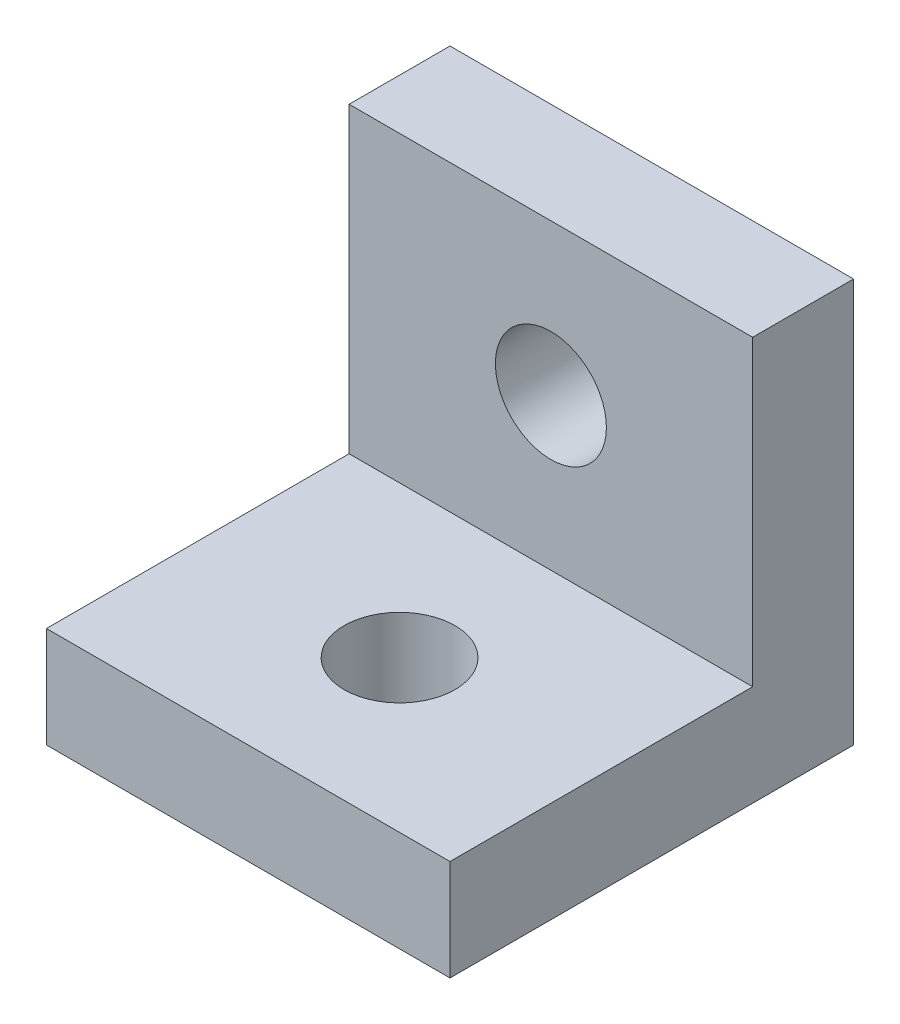
ISO-10303-21;
HEADER;
FILE_DESCRIPTION(('STEP AP214'),'2;1');
FILE_NAME('part.step','',(''),(''),'','','');
FILE_SCHEMA(('AUTOMOTIVE_DESIGN { 1 0 10303 214 1 1 1 1 }'));
ENDSEC;
DATA;
#1=APPLICATION_CONTEXT('core data for automotive mechanical design processes');
#2=APPLICATION_PROTOCOL_DEFINITION('international standard','automotive_design',2000,#1);
#3=PRODUCT_CONTEXT('',#1,'mechanical');
#4=PRODUCT('Part','Part','',(#3));
#5=PRODUCT_RELATED_PRODUCT_CATEGORY('part','',(#4));
#6=PRODUCT_DEFINITION_FORMATION('','',#4);
#7=PRODUCT_DEFINITION_CONTEXT('part definition',#1,'design');
#8=PRODUCT_DEFINITION('design','',#6,#7);
#9=PRODUCT_DEFINITION_SHAPE('','',#8);
#10=(LENGTH_UNIT() NAMED_UNIT(*) SI_UNIT(.MILLI.,.METRE.));
#11=(NAMED_UNIT(*) PLANE_ANGLE_UNIT() SI_UNIT($,.RADIAN.));
#12=(NAMED_UNIT(*) SI_UNIT($,.STERADIAN.) SOLID_ANGLE_UNIT());
#13=UNCERTAINTY_MEASURE_WITH_UNIT(LENGTH_MEASURE(1.E-05),#10,'distance_accuracy_value','');
#14=(GEOMETRIC_REPRESENTATION_CONTEXT(3) GLOBAL_UNCERTAINTY_ASSIGNED_CONTEXT((#13)) GLOBAL_UNIT_ASSIGNED_CONTEXT((#10,
#11,#12)) REPRESENTATION_CONTEXT('',''));
#15=CARTESIAN_POINT('',(0.,0.,0.));
#16=DIRECTION('',(0.,0.,1.));
#17=DIRECTION('',(1.,0.,0.));
#18=AXIS2_PLACEMENT_3D('',#15,#16,#17);
#19=CARTESIAN_POINT('',(0.,0.,2.54));
#20=DIRECTION('',(0.,0.,-1.));
#21=DIRECTION('',(-1.,0.,0.));
#22=AXIS2_PLACEMENT_3D('',#19,#20,#21);
#23=PLANE('',#22);
#24=CARTESIAN_POINT('',(5.08,6.35,2.54));
#25=DIRECTION('',(0.,0.,1.));
#26=DIRECTION('',(1.,0.,0.));
#27=AXIS2_PLACEMENT_3D('',#24,#25,#26);
#28=CIRCLE('',#27,1.397);
#29=CARTESIAN_POINT('',(6.477,6.35,2.54));
#30=VERTEX_POINT('',#29);
#31=EDGE_CURVE('E203',#30,#30,#28,.T.);
#32=ORIENTED_EDGE('',*,*,#31,.F.);
#33=EDGE_LOOP('',(#32));
#34=FACE_BOUND('',#33,.T.);
#35=DIRECTION('',(-1.,0.,0.));
#36=VECTOR('',#35,1.);
#37=CARTESIAN_POINT('',(0.,2.54,2.54));
#38=LINE('',#37,#36);
#39=CARTESIAN_POINT('',(10.16,2.54,2.54));
#40=VERTEX_POINT('',#39);
#41=CARTESIAN_POINT('',(0.,2.54,2.54));
#42=VERTEX_POINT('',#41);
#43=EDGE_CURVE('E56',#40,#42,#38,.T.);
#44=ORIENTED_EDGE('',*,*,#43,.F.);
#45=DIRECTION('',(0.,1.,0.));
#46=VECTOR('',#45,1.);
#47=CARTESIAN_POINT('',(10.16,0.,2.54));
#48=LINE('',#47,#46);
#49=CARTESIAN_POINT('',(10.16,10.16,2.54));
#50=VERTEX_POINT('',#49);
#51=EDGE_CURVE('E160',#40,#50,#48,.T.);
#52=ORIENTED_EDGE('',*,*,#51,.T.);
#53=DIRECTION('',(-1.,0.,0.));
#54=VECTOR('',#53,1.);
#55=CARTESIAN_POINT('',(0.,10.16,2.54));
#56=LINE('',#55,#54);
#57=CARTESIAN_POINT('',(0.,10.16,2.54));
#58=VERTEX_POINT('',#57);
#59=EDGE_CURVE('E62',#50,#58,#56,.T.);
#60=ORIENTED_EDGE('',*,*,#59,.T.);
#61=DIRECTION('',(0.,-1.,0.));
#62=VECTOR('',#61,1.);
#63=CARTESIAN_POINT('',(0.,0.,2.54));
#64=LINE('',#63,#62);
#65=EDGE_CURVE('E92',#58,#42,#64,.T.);
#66=ORIENTED_EDGE('',*,*,#65,.T.);
#67=EDGE_LOOP('',(#44,#52,#60,#66));
#68=FACE_BOUND('',#67,.T.);
#69=ADVANCED_FACE('F39',(#34,#68),#23,.F.);
#70=CARTESIAN_POINT('',(0.,0.,2.54));
#71=DIRECTION('',(1.,0.,0.));
#72=DIRECTION('',(0.,0.,-1.));
#73=AXIS2_PLACEMENT_3D('',#70,#71,#72);
#74=PLANE('',#73);
#75=DIRECTION('',(0.,-1.,0.));
#76=VECTOR('',#75,1.);
#77=CARTESIAN_POINT('',(0.,0.,0.));
#78=LINE('',#77,#76);
#79=CARTESIAN_POINT('',(0.,10.16,0.));
#80=VERTEX_POINT('',#79);
#81=CARTESIAN_POINT('',(0.,0.,0.));
#82=VERTEX_POINT('',#81);
#83=EDGE_CURVE('E98',#80,#82,#78,.T.);
#84=ORIENTED_EDGE('',*,*,#83,.T.);
#85=DIRECTION('',(0.,0.,-1.));
#86=VECTOR('',#85,1.);
#87=CARTESIAN_POINT('',(0.,0.,2.54));
#88=LINE('',#87,#86);
#89=CARTESIAN_POINT('',(0.,0.,10.16));
#90=VERTEX_POINT('',#89);
#91=EDGE_CURVE('E11',#90,#82,#88,.T.);
#92=ORIENTED_EDGE('',*,*,#91,.F.);
#93=DIRECTION('',(0.,-1.,0.));
#94=VECTOR('',#93,1.);
#95=CARTESIAN_POINT('',(0.,0.,10.16));
#96=LINE('',#95,#94);
#97=CARTESIAN_POINT('',(0.,2.54,10.16));
#98=VERTEX_POINT('',#97);
#99=EDGE_CURVE('E143',#98,#90,#96,.T.);
#100=ORIENTED_EDGE('',*,*,#99,.F.);
#101=DIRECTION('',(0.,0.,-1.));
#102=VECTOR('',#101,1.);
#103=CARTESIAN_POINT('',(0.,2.54,10.16));
#104=LINE('',#103,#102);
#105=EDGE_CURVE('E111',#98,#42,#104,.T.);
#106=ORIENTED_EDGE('',*,*,#105,.T.);
#107=ORIENTED_EDGE('',*,*,#65,.F.);
#108=DIRECTION('',(0.,0.,-1.));
#109=VECTOR('',#108,1.);
#110=CARTESIAN_POINT('',(0.,10.16,2.54));
#111=LINE('',#110,#109);
#112=EDGE_CURVE('E84',#58,#80,#111,.T.);
#113=ORIENTED_EDGE('',*,*,#112,.T.);
#114=EDGE_LOOP('',(#84,#92,#100,#106,#107,#113));
#115=FACE_BOUND('',#114,.T.);
#116=ADVANCED_FACE('F41',(#115),#74,.F.);
#117=CARTESIAN_POINT('',(0.,0.,2.54));
#118=DIRECTION('',(0.,1.,0.));
#119=DIRECTION('',(0.,0.,1.));
#120=AXIS2_PLACEMENT_3D('',#117,#118,#119);
#121=PLANE('',#120);
#122=CARTESIAN_POINT('',(5.08,0.,6.35));
#123=DIRECTION('',(0.,1.,0.));
#124=DIRECTION('',(0.,0.,1.));
#125=AXIS2_PLACEMENT_3D('',#122,#123,#124);
#126=CIRCLE('',#125,1.397);
#127=CARTESIAN_POINT('',(5.08,0.,7.747));
#128=VERTEX_POINT('',#127);
#129=EDGE_CURVE('E200',#128,#128,#126,.T.);
#130=ORIENTED_EDGE('',*,*,#129,.T.);
#131=EDGE_LOOP('',(#130));
#132=FACE_BOUND('',#131,.T.);
#133=DIRECTION('',(1.,0.,0.));
#134=VECTOR('',#133,1.);
#135=CARTESIAN_POINT('',(0.,0.,0.));
#136=LINE('',#135,#134);
#137=CARTESIAN_POINT('',(10.16,0.,0.));
#138=VERTEX_POINT('',#137);
#139=EDGE_CURVE('E103',#82,#138,#136,.T.);
#140=ORIENTED_EDGE('',*,*,#139,.T.);
#141=DIRECTION('',(0.,0.,-1.));
#142=VECTOR('',#141,1.);
#143=CARTESIAN_POINT('',(10.16,0.,2.54));
#144=LINE('',#143,#142);
#145=CARTESIAN_POINT('',(10.16,0.,10.16));
#146=VERTEX_POINT('',#145);
#147=EDGE_CURVE('E49',#146,#138,#144,.T.);
#148=ORIENTED_EDGE('',*,*,#147,.F.);
#149=DIRECTION('',(1.,0.,0.));
#150=VECTOR('',#149,1.);
#151=CARTESIAN_POINT('',(0.,0.,10.16));
#152=LINE('',#151,#150);
#153=EDGE_CURVE('E135',#90,#146,#152,.T.);
#154=ORIENTED_EDGE('',*,*,#153,.F.);
#155=ORIENTED_EDGE('',*,*,#91,.T.);
#156=EDGE_LOOP('',(#140,#148,#154,#155));
#157=FACE_BOUND('',#156,.T.);
#158=ADVANCED_FACE('F133',(#132,#157),#121,.F.);
#159=CARTESIAN_POINT('',(10.16,0.,2.54));
#160=DIRECTION('',(-1.,0.,0.));
#161=DIRECTION('',(0.,0.,1.));
#162=AXIS2_PLACEMENT_3D('',#159,#160,#161);
#163=PLANE('',#162);
#164=DIRECTION('',(0.,1.,0.));
#165=VECTOR('',#164,1.);
#166=CARTESIAN_POINT('',(10.16,0.,0.));
#167=LINE('',#166,#165);
#168=CARTESIAN_POINT('',(10.16,10.16,0.));
#169=VERTEX_POINT('',#168);
#170=EDGE_CURVE('E93',#138,#169,#167,.T.);
#171=ORIENTED_EDGE('',*,*,#170,.T.);
#172=DIRECTION('',(0.,0.,-1.));
#173=VECTOR('',#172,1.);
#174=CARTESIAN_POINT('',(10.16,10.16,2.54));
#175=LINE('',#174,#173);
#176=EDGE_CURVE('E87',#50,#169,#175,.T.);
#177=ORIENTED_EDGE('',*,*,#176,.F.);
#178=ORIENTED_EDGE('',*,*,#51,.F.);
#179=DIRECTION('',(0.,0.,-1.));
#180=VECTOR('',#179,1.);
#181=CARTESIAN_POINT('',(10.16,2.54,10.16));
#182=LINE('',#181,#180);
#183=CARTESIAN_POINT('',(10.16,2.54,10.16));
#184=VERTEX_POINT('',#183);
#185=EDGE_CURVE('E105',#184,#40,#182,.T.);
#186=ORIENTED_EDGE('',*,*,#185,.F.);
#187=DIRECTION('',(0.,1.,0.));
#188=VECTOR('',#187,1.);
#189=CARTESIAN_POINT('',(10.16,0.,10.16));
#190=LINE('',#189,#188);
#191=EDGE_CURVE('E129',#146,#184,#190,.T.);
#192=ORIENTED_EDGE('',*,*,#191,.F.);
#193=ORIENTED_EDGE('',*,*,#147,.T.);
#194=EDGE_LOOP('',(#171,#177,#178,#186,#192,#193));
#195=FACE_BOUND('',#194,.T.);
#196=ADVANCED_FACE('F125',(#195),#163,.F.);
#197=CARTESIAN_POINT('',(0.,10.16,2.54));
#198=DIRECTION('',(0.,-1.,0.));
#199=DIRECTION('',(0.,0.,-1.));
#200=AXIS2_PLACEMENT_3D('',#197,#198,#199);
#201=PLANE('',#200);
#202=DIRECTION('',(-1.,0.,0.));
#203=VECTOR('',#202,1.);
#204=CARTESIAN_POINT('',(0.,10.16,0.));
#205=LINE('',#204,#203);
#206=EDGE_CURVE('E81',#169,#80,#205,.T.);
#207=ORIENTED_EDGE('',*,*,#206,.T.);
#208=ORIENTED_EDGE('',*,*,#112,.F.);
#209=ORIENTED_EDGE('',*,*,#59,.F.);
#210=ORIENTED_EDGE('',*,*,#176,.T.);
#211=EDGE_LOOP('',(#207,#208,#209,#210));
#212=FACE_BOUND('',#211,.T.);
#213=ADVANCED_FACE('F83',(#212),#201,.F.);
#214=CARTESIAN_POINT('',(0.,0.,0.));
#215=DIRECTION('',(0.,0.,-1.));
#216=DIRECTION('',(-1.,0.,0.));
#217=AXIS2_PLACEMENT_3D('',#214,#215,#216);
#218=PLANE('',#217);
#219=CARTESIAN_POINT('',(5.08,6.35,0.));
#220=DIRECTION('',(0.,0.,-1.));
#221=DIRECTION('',(-1.,0.,0.));
#222=AXIS2_PLACEMENT_3D('',#219,#220,#221);
#223=CIRCLE('',#222,1.397);
#224=CARTESIAN_POINT('',(3.683,6.35,0.));
#225=VERTEX_POINT('',#224);
#226=EDGE_CURVE('E43',#225,#225,#223,.T.);
#227=ORIENTED_EDGE('',*,*,#226,.F.);
#228=EDGE_LOOP('',(#227));
#229=FACE_BOUND('',#228,.T.);
#230=ORIENTED_EDGE('',*,*,#83,.F.);
#231=ORIENTED_EDGE('',*,*,#206,.F.);
#232=ORIENTED_EDGE('',*,*,#170,.F.);
#233=ORIENTED_EDGE('',*,*,#139,.F.);
#234=EDGE_LOOP('',(#230,#231,#232,#233));
#235=FACE_BOUND('',#234,.T.);
#236=ADVANCED_FACE('F102',(#229,#235),#218,.T.);
#237=CARTESIAN_POINT('',(0.,2.54,10.16));
#238=DIRECTION('',(0.,-1.,0.));
#239=DIRECTION('',(0.,0.,-1.));
#240=AXIS2_PLACEMENT_3D('',#237,#238,#239);
#241=PLANE('',#240);
#242=CARTESIAN_POINT('',(5.08,2.54,6.35));
#243=DIRECTION('',(0.,1.,0.));
#244=DIRECTION('',(0.,0.,1.));
#245=AXIS2_PLACEMENT_3D('',#242,#243,#244);
#246=CIRCLE('',#245,1.397);
#247=CARTESIAN_POINT('',(5.08,2.54,7.747));
#248=VERTEX_POINT('',#247);
#249=EDGE_CURVE('E204',#248,#248,#246,.T.);
#250=ORIENTED_EDGE('',*,*,#249,.F.);
#251=EDGE_LOOP('',(#250));
#252=FACE_BOUND('',#251,.T.);
#253=ORIENTED_EDGE('',*,*,#43,.T.);
#254=ORIENTED_EDGE('',*,*,#105,.F.);
#255=DIRECTION('',(-1.,0.,0.));
#256=VECTOR('',#255,1.);
#257=CARTESIAN_POINT('',(0.,2.54,10.16));
#258=LINE('',#257,#256);
#259=EDGE_CURVE('E148',#184,#98,#258,.T.);
#260=ORIENTED_EDGE('',*,*,#259,.F.);
#261=ORIENTED_EDGE('',*,*,#185,.T.);
#262=EDGE_LOOP('',(#253,#254,#260,#261));
#263=FACE_BOUND('',#262,.T.);
#264=ADVANCED_FACE('F165',(#252,#263),#241,.F.);
#265=CARTESIAN_POINT('',(0.,0.,10.16));
#266=DIRECTION('',(0.,0.,-1.));
#267=DIRECTION('',(-1.,0.,0.));
#268=AXIS2_PLACEMENT_3D('',#265,#266,#267);
#269=PLANE('',#268);
#270=ORIENTED_EDGE('',*,*,#99,.T.);
#271=ORIENTED_EDGE('',*,*,#153,.T.);
#272=ORIENTED_EDGE('',*,*,#191,.T.);
#273=ORIENTED_EDGE('',*,*,#259,.T.);
#274=EDGE_LOOP('',(#270,#271,#272,#273));
#275=FACE_BOUND('',#274,.T.);
#276=ADVANCED_FACE('F140',(#275),#269,.F.);
#277=CARTESIAN_POINT('',(5.08,6.35,-7.62));
#278=DIRECTION('',(0.,0.,1.));
#279=DIRECTION('',(1.,0.,0.));
#280=AXIS2_PLACEMENT_3D('',#277,#278,#279);
#281=CYLINDRICAL_SURFACE('',#280,1.397);
#282=ORIENTED_EDGE('',*,*,#226,.T.);
#283=EDGE_LOOP('',(#282));
#284=FACE_BOUND('',#283,.T.);
#285=ORIENTED_EDGE('',*,*,#31,.T.);
#286=EDGE_LOOP('',(#285));
#287=FACE_BOUND('',#286,.T.);
#288=ADVANCED_FACE('F178',(#284,#287),#281,.F.);
#289=CARTESIAN_POINT('',(5.08,-7.62,6.35));
#290=DIRECTION('',(0.,1.,0.));
#291=DIRECTION('',(0.,0.,1.));
#292=AXIS2_PLACEMENT_3D('',#289,#290,#291);
#293=CYLINDRICAL_SURFACE('',#292,1.397);
#294=ORIENTED_EDGE('',*,*,#249,.T.);
#295=EDGE_LOOP('',(#294));
#296=FACE_BOUND('',#295,.T.);
#297=ORIENTED_EDGE('',*,*,#129,.F.);
#298=EDGE_LOOP('',(#297));
#299=FACE_BOUND('',#298,.T.);
#300=ADVANCED_FACE('F212',(#296,#299),#293,.F.);
#301=CLOSED_SHELL('',(#69,#116,#158,#196,#213,#236,#264,#276,#288,#300));
#302=MANIFOLD_SOLID_BREP('B2',#301);
#303=ADVANCED_BREP_SHAPE_REPRESENTATION('',(#18,#302),#14);
#304=SHAPE_DEFINITION_REPRESENTATION(#9,#303);
ENDSEC;
END-ISO-10303-21;
